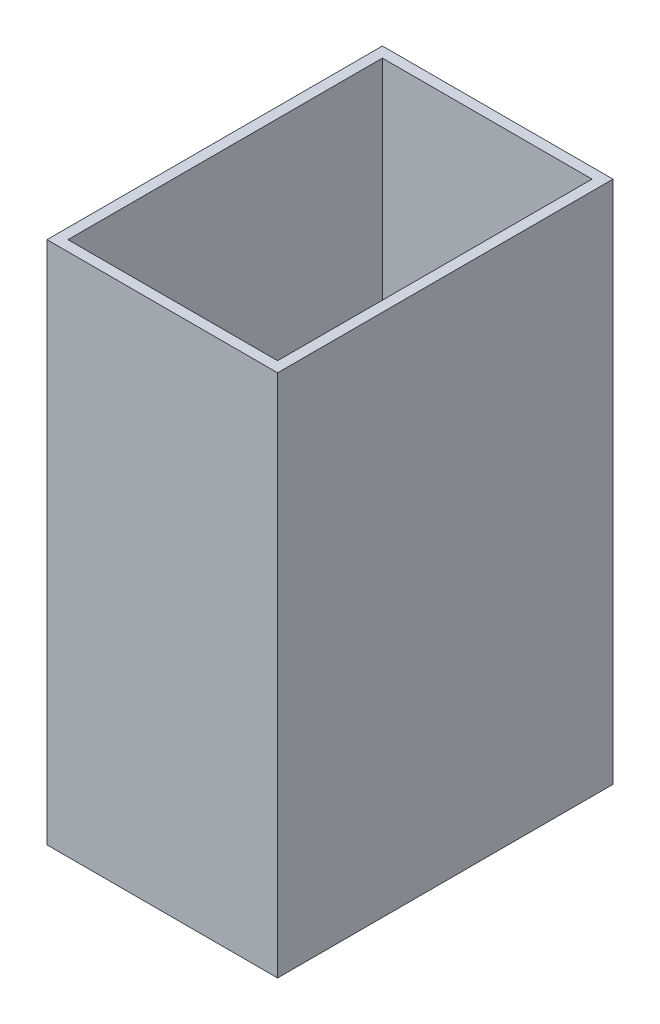
ISO-10303-21;
HEADER;
FILE_DESCRIPTION(('STEP AP214'),'2;1');
FILE_NAME('part.step','',(''),(''),'','','');
FILE_SCHEMA(('AUTOMOTIVE_DESIGN { 1 0 10303 214 1 1 1 1 }'));
ENDSEC;
DATA;
#1=APPLICATION_CONTEXT('core data for automotive mechanical design processes');
#2=APPLICATION_PROTOCOL_DEFINITION('international standard','automotive_design',2000,#1);
#3=PRODUCT_CONTEXT('',#1,'mechanical');
#4=PRODUCT('Part','Part','',(#3));
#5=PRODUCT_RELATED_PRODUCT_CATEGORY('part','',(#4));
#6=PRODUCT_DEFINITION_FORMATION('','',#4);
#7=PRODUCT_DEFINITION_CONTEXT('part definition',#1,'design');
#8=PRODUCT_DEFINITION('design','',#6,#7);
#9=PRODUCT_DEFINITION_SHAPE('','',#8);
#10=(LENGTH_UNIT() NAMED_UNIT(*) SI_UNIT(.MILLI.,.METRE.));
#11=(NAMED_UNIT(*) PLANE_ANGLE_UNIT() SI_UNIT($,.RADIAN.));
#12=(NAMED_UNIT(*) SI_UNIT($,.STERADIAN.) SOLID_ANGLE_UNIT());
#13=UNCERTAINTY_MEASURE_WITH_UNIT(LENGTH_MEASURE(1.E-05),#10,'distance_accuracy_value','');
#14=(GEOMETRIC_REPRESENTATION_CONTEXT(3) GLOBAL_UNCERTAINTY_ASSIGNED_CONTEXT((#13)) GLOBAL_UNIT_ASSIGNED_CONTEXT((#10,
#11,#12)) REPRESENTATION_CONTEXT('',''));
#15=CARTESIAN_POINT('',(0.,0.,0.));
#16=DIRECTION('',(0.,0.,1.));
#17=DIRECTION('',(1.,0.,0.));
#18=AXIS2_PLACEMENT_3D('',#15,#16,#17);
#19=CARTESIAN_POINT('',(0.,500.,0.));
#20=DIRECTION('',(0.,1.,0.));
#21=DIRECTION('',(0.,0.,1.));
#22=AXIS2_PLACEMENT_3D('',#19,#20,#21);
#23=PLANE('',#22);
#24=DIRECTION('',(0.,0.,-1.));
#25=VECTOR('',#24,1.);
#26=CARTESIAN_POINT('',(110.,500.,-160.));
#27=LINE('',#26,#25);
#28=CARTESIAN_POINT('',(110.,500.,160.));
#29=VERTEX_POINT('',#28);
#30=CARTESIAN_POINT('',(110.,500.,-160.));
#31=VERTEX_POINT('',#30);
#32=EDGE_CURVE('E136',#29,#31,#27,.T.);
#33=ORIENTED_EDGE('',*,*,#32,.T.);
#34=DIRECTION('',(-1.,0.,0.));
#35=VECTOR('',#34,1.);
#36=CARTESIAN_POINT('',(-110.,500.,-160.));
#37=LINE('',#36,#35);
#38=CARTESIAN_POINT('',(-110.,500.,-160.));
#39=VERTEX_POINT('',#38);
#40=EDGE_CURVE('E139',#31,#39,#37,.T.);
#41=ORIENTED_EDGE('',*,*,#40,.T.);
#42=DIRECTION('',(0.,0.,1.));
#43=VECTOR('',#42,1.);
#44=CARTESIAN_POINT('',(-110.,500.,-160.));
#45=LINE('',#44,#43);
#46=CARTESIAN_POINT('',(-110.,500.,160.));
#47=VERTEX_POINT('',#46);
#48=EDGE_CURVE('E142',#39,#47,#45,.T.);
#49=ORIENTED_EDGE('',*,*,#48,.T.);
#50=DIRECTION('',(1.,0.,0.));
#51=VECTOR('',#50,1.);
#52=CARTESIAN_POINT('',(-110.,500.,160.));
#53=LINE('',#52,#51);
#54=EDGE_CURVE('E144',#47,#29,#53,.T.);
#55=ORIENTED_EDGE('',*,*,#54,.T.);
#56=EDGE_LOOP('',(#33,#41,#49,#55));
#57=FACE_BOUND('',#56,.T.);
#58=DIRECTION('',(-1.,0.,0.));
#59=VECTOR('',#58,1.);
#60=CARTESIAN_POINT('',(-100.,500.,-150.));
#61=LINE('',#60,#59);
#62=CARTESIAN_POINT('',(100.,500.,-150.));
#63=VERTEX_POINT('',#62);
#64=CARTESIAN_POINT('',(-100.,500.,-150.));
#65=VERTEX_POINT('',#64);
#66=EDGE_CURVE('E108',#63,#65,#61,.T.);
#67=ORIENTED_EDGE('',*,*,#66,.F.);
#68=DIRECTION('',(0.,0.,-1.));
#69=VECTOR('',#68,1.);
#70=CARTESIAN_POINT('',(100.,500.,-150.));
#71=LINE('',#70,#69);
#72=CARTESIAN_POINT('',(100.,500.,150.));
#73=VERTEX_POINT('',#72);
#74=EDGE_CURVE('E100',#73,#63,#71,.T.);
#75=ORIENTED_EDGE('',*,*,#74,.F.);
#76=DIRECTION('',(1.,0.,0.));
#77=VECTOR('',#76,1.);
#78=CARTESIAN_POINT('',(-99.9999999999999,500.,150.));
#79=LINE('',#78,#77);
#80=CARTESIAN_POINT('',(-99.9999999999999,500.,150.));
#81=VERTEX_POINT('',#80);
#82=EDGE_CURVE('E122',#81,#73,#79,.T.);
#83=ORIENTED_EDGE('',*,*,#82,.F.);
#84=DIRECTION('',(0.,0.,1.));
#85=VECTOR('',#84,1.);
#86=CARTESIAN_POINT('',(-100.,500.,-150.));
#87=LINE('',#86,#85);
#88=EDGE_CURVE('E120',#65,#81,#87,.T.);
#89=ORIENTED_EDGE('',*,*,#88,.F.);
#90=EDGE_LOOP('',(#67,#75,#83,#89));
#91=FACE_BOUND('',#90,.T.);
#92=ADVANCED_FACE('F35',(#57,#91),#23,.T.);
#93=CARTESIAN_POINT('',(0.,0.,0.));
#94=DIRECTION('',(0.,1.,0.));
#95=DIRECTION('',(0.,0.,1.));
#96=AXIS2_PLACEMENT_3D('',#93,#94,#95);
#97=PLANE('',#96);
#98=DIRECTION('',(0.,0.,-1.));
#99=VECTOR('',#98,1.);
#100=CARTESIAN_POINT('',(110.,0.,-160.));
#101=LINE('',#100,#99);
#102=CARTESIAN_POINT('',(110.,0.,160.));
#103=VERTEX_POINT('',#102);
#104=CARTESIAN_POINT('',(110.,0.,-160.));
#105=VERTEX_POINT('',#104);
#106=EDGE_CURVE('E116',#103,#105,#101,.T.);
#107=ORIENTED_EDGE('',*,*,#106,.F.);
#108=DIRECTION('',(1.,0.,0.));
#109=VECTOR('',#108,1.);
#110=CARTESIAN_POINT('',(-110.,0.,160.));
#111=LINE('',#110,#109);
#112=CARTESIAN_POINT('',(-110.,0.,160.));
#113=VERTEX_POINT('',#112);
#114=EDGE_CURVE('E140',#113,#103,#111,.T.);
#115=ORIENTED_EDGE('',*,*,#114,.F.);
#116=DIRECTION('',(0.,0.,1.));
#117=VECTOR('',#116,1.);
#118=CARTESIAN_POINT('',(-110.,0.,-160.));
#119=LINE('',#118,#117);
#120=CARTESIAN_POINT('',(-110.,0.,-160.));
#121=VERTEX_POINT('',#120);
#122=EDGE_CURVE('E151',#121,#113,#119,.T.);
#123=ORIENTED_EDGE('',*,*,#122,.F.);
#124=DIRECTION('',(-1.,0.,0.));
#125=VECTOR('',#124,1.);
#126=CARTESIAN_POINT('',(-110.,0.,-160.));
#127=LINE('',#126,#125);
#128=EDGE_CURVE('E149',#105,#121,#127,.T.);
#129=ORIENTED_EDGE('',*,*,#128,.F.);
#130=EDGE_LOOP('',(#107,#115,#123,#129));
#131=FACE_BOUND('',#130,.T.);
#132=DIRECTION('',(0.,0.,-1.));
#133=VECTOR('',#132,1.);
#134=CARTESIAN_POINT('',(100.,0.,-150.));
#135=LINE('',#134,#133);
#136=CARTESIAN_POINT('',(100.,0.,150.));
#137=VERTEX_POINT('',#136);
#138=CARTESIAN_POINT('',(100.,0.,-150.));
#139=VERTEX_POINT('',#138);
#140=EDGE_CURVE('E58',#137,#139,#135,.T.);
#141=ORIENTED_EDGE('',*,*,#140,.T.);
#142=DIRECTION('',(-1.,0.,0.));
#143=VECTOR('',#142,1.);
#144=CARTESIAN_POINT('',(-100.,0.,-150.));
#145=LINE('',#144,#143);
#146=CARTESIAN_POINT('',(-100.,0.,-150.));
#147=VERTEX_POINT('',#146);
#148=EDGE_CURVE('E115',#139,#147,#145,.T.);
#149=ORIENTED_EDGE('',*,*,#148,.T.);
#150=DIRECTION('',(0.,0.,1.));
#151=VECTOR('',#150,1.);
#152=CARTESIAN_POINT('',(-100.,0.,-150.));
#153=LINE('',#152,#151);
#154=CARTESIAN_POINT('',(-99.9999999999999,0.,150.));
#155=VERTEX_POINT('',#154);
#156=EDGE_CURVE('E128',#147,#155,#153,.T.);
#157=ORIENTED_EDGE('',*,*,#156,.T.);
#158=DIRECTION('',(1.,0.,0.));
#159=VECTOR('',#158,1.);
#160=CARTESIAN_POINT('',(-99.9999999999999,0.,150.));
#161=LINE('',#160,#159);
#162=EDGE_CURVE('E109',#155,#137,#161,.T.);
#163=ORIENTED_EDGE('',*,*,#162,.T.);
#164=EDGE_LOOP('',(#141,#149,#157,#163));
#165=FACE_BOUND('',#164,.T.);
#166=ADVANCED_FACE('F169',(#131,#165),#97,.F.);
#167=CARTESIAN_POINT('',(110.,500.,-160.));
#168=DIRECTION('',(-1.,0.,0.));
#169=DIRECTION('',(0.,0.,1.));
#170=AXIS2_PLACEMENT_3D('',#167,#168,#169);
#171=PLANE('',#170);
#172=ORIENTED_EDGE('',*,*,#106,.T.);
#173=DIRECTION('',(0.,-1.,0.));
#174=VECTOR('',#173,1.);
#175=CARTESIAN_POINT('',(110.,500.,-160.));
#176=LINE('',#175,#174);
#177=EDGE_CURVE('E11',#31,#105,#176,.T.);
#178=ORIENTED_EDGE('',*,*,#177,.F.);
#179=ORIENTED_EDGE('',*,*,#32,.F.);
#180=DIRECTION('',(0.,-1.,0.));
#181=VECTOR('',#180,1.);
#182=CARTESIAN_POINT('',(110.,500.,160.));
#183=LINE('',#182,#181);
#184=EDGE_CURVE('E146',#29,#103,#183,.T.);
#185=ORIENTED_EDGE('',*,*,#184,.T.);
#186=EDGE_LOOP('',(#172,#178,#179,#185));
#187=FACE_BOUND('',#186,.T.);
#188=ADVANCED_FACE('F37',(#187),#171,.F.);
#189=CARTESIAN_POINT('',(-110.,500.,-160.));
#190=DIRECTION('',(0.,0.,1.));
#191=DIRECTION('',(1.,0.,0.));
#192=AXIS2_PLACEMENT_3D('',#189,#190,#191);
#193=PLANE('',#192);
#194=ORIENTED_EDGE('',*,*,#128,.T.);
#195=DIRECTION('',(0.,-1.,0.));
#196=VECTOR('',#195,1.);
#197=CARTESIAN_POINT('',(-110.,500.,-160.));
#198=LINE('',#197,#196);
#199=EDGE_CURVE('E43',#39,#121,#198,.T.);
#200=ORIENTED_EDGE('',*,*,#199,.F.);
#201=ORIENTED_EDGE('',*,*,#40,.F.);
#202=ORIENTED_EDGE('',*,*,#177,.T.);
#203=EDGE_LOOP('',(#194,#200,#201,#202));
#204=FACE_BOUND('',#203,.T.);
#205=ADVANCED_FACE('F179',(#204),#193,.F.);
#206=CARTESIAN_POINT('',(-110.,500.,-160.));
#207=DIRECTION('',(1.,0.,0.));
#208=DIRECTION('',(0.,0.,-1.));
#209=AXIS2_PLACEMENT_3D('',#206,#207,#208);
#210=PLANE('',#209);
#211=ORIENTED_EDGE('',*,*,#122,.T.);
#212=DIRECTION('',(0.,-1.,0.));
#213=VECTOR('',#212,1.);
#214=CARTESIAN_POINT('',(-110.,500.,160.));
#215=LINE('',#214,#213);
#216=EDGE_CURVE('E156',#47,#113,#215,.T.);
#217=ORIENTED_EDGE('',*,*,#216,.F.);
#218=ORIENTED_EDGE('',*,*,#48,.F.);
#219=ORIENTED_EDGE('',*,*,#199,.T.);
#220=EDGE_LOOP('',(#211,#217,#218,#219));
#221=FACE_BOUND('',#220,.T.);
#222=ADVANCED_FACE('F163',(#221),#210,.F.);
#223=CARTESIAN_POINT('',(-110.,500.,160.));
#224=DIRECTION('',(0.,0.,-1.));
#225=DIRECTION('',(-1.,0.,0.));
#226=AXIS2_PLACEMENT_3D('',#223,#224,#225);
#227=PLANE('',#226);
#228=ORIENTED_EDGE('',*,*,#114,.T.);
#229=ORIENTED_EDGE('',*,*,#184,.F.);
#230=ORIENTED_EDGE('',*,*,#54,.F.);
#231=ORIENTED_EDGE('',*,*,#216,.T.);
#232=EDGE_LOOP('',(#228,#229,#230,#231));
#233=FACE_BOUND('',#232,.T.);
#234=ADVANCED_FACE('F173',(#233),#227,.F.);
#235=CARTESIAN_POINT('',(100.,500.,-150.));
#236=DIRECTION('',(-1.,0.,0.));
#237=DIRECTION('',(0.,0.,1.));
#238=AXIS2_PLACEMENT_3D('',#235,#236,#237);
#239=PLANE('',#238);
#240=ORIENTED_EDGE('',*,*,#140,.F.);
#241=DIRECTION('',(0.,-1.,0.));
#242=VECTOR('',#241,1.);
#243=CARTESIAN_POINT('',(100.,500.,150.));
#244=LINE('',#243,#242);
#245=EDGE_CURVE('E104',#73,#137,#244,.T.);
#246=ORIENTED_EDGE('',*,*,#245,.F.);
#247=ORIENTED_EDGE('',*,*,#74,.T.);
#248=DIRECTION('',(0.,-1.,0.));
#249=VECTOR('',#248,1.);
#250=CARTESIAN_POINT('',(100.,500.,-150.));
#251=LINE('',#250,#249);
#252=EDGE_CURVE('E103',#63,#139,#251,.T.);
#253=ORIENTED_EDGE('',*,*,#252,.T.);
#254=EDGE_LOOP('',(#240,#246,#247,#253));
#255=FACE_BOUND('',#254,.T.);
#256=ADVANCED_FACE('F102',(#255),#239,.T.);
#257=CARTESIAN_POINT('',(-100.,500.,-150.));
#258=DIRECTION('',(0.,0.,1.));
#259=DIRECTION('',(1.,0.,0.));
#260=AXIS2_PLACEMENT_3D('',#257,#258,#259);
#261=PLANE('',#260);
#262=ORIENTED_EDGE('',*,*,#148,.F.);
#263=ORIENTED_EDGE('',*,*,#252,.F.);
#264=ORIENTED_EDGE('',*,*,#66,.T.);
#265=DIRECTION('',(0.,-1.,0.));
#266=VECTOR('',#265,1.);
#267=CARTESIAN_POINT('',(-100.,500.,-150.));
#268=LINE('',#267,#266);
#269=EDGE_CURVE('E117',#65,#147,#268,.T.);
#270=ORIENTED_EDGE('',*,*,#269,.T.);
#271=EDGE_LOOP('',(#262,#263,#264,#270));
#272=FACE_BOUND('',#271,.T.);
#273=ADVANCED_FACE('F112',(#272),#261,.T.);
#274=CARTESIAN_POINT('',(-100.,500.,-150.));
#275=DIRECTION('',(1.,0.,0.));
#276=DIRECTION('',(0.,0.,-1.));
#277=AXIS2_PLACEMENT_3D('',#274,#275,#276);
#278=PLANE('',#277);
#279=ORIENTED_EDGE('',*,*,#156,.F.);
#280=ORIENTED_EDGE('',*,*,#269,.F.);
#281=ORIENTED_EDGE('',*,*,#88,.T.);
#282=DIRECTION('',(0.,-1.,0.));
#283=VECTOR('',#282,1.);
#284=CARTESIAN_POINT('',(-99.9999999999999,500.,150.));
#285=LINE('',#284,#283);
#286=EDGE_CURVE('E50',#81,#155,#285,.T.);
#287=ORIENTED_EDGE('',*,*,#286,.T.);
#288=EDGE_LOOP('',(#279,#280,#281,#287));
#289=FACE_BOUND('',#288,.T.);
#290=ADVANCED_FACE('F202',(#289),#278,.T.);
#291=CARTESIAN_POINT('',(-99.9999999999999,500.,150.));
#292=DIRECTION('',(0.,0.,-1.));
#293=DIRECTION('',(-1.,0.,0.));
#294=AXIS2_PLACEMENT_3D('',#291,#292,#293);
#295=PLANE('',#294);
#296=ORIENTED_EDGE('',*,*,#162,.F.);
#297=ORIENTED_EDGE('',*,*,#286,.F.);
#298=ORIENTED_EDGE('',*,*,#82,.T.);
#299=ORIENTED_EDGE('',*,*,#245,.T.);
#300=EDGE_LOOP('',(#296,#297,#298,#299));
#301=FACE_BOUND('',#300,.T.);
#302=ADVANCED_FACE('F206',(#301),#295,.T.);
#303=CLOSED_SHELL('',(#92,#166,#188,#205,#222,#234,#256,#273,#290,#302));
#304=MANIFOLD_SOLID_BREP('B2',#303);
#305=ADVANCED_BREP_SHAPE_REPRESENTATION('',(#18,#304),#14);
#306=SHAPE_DEFINITION_REPRESENTATION(#9,#305);
ENDSEC;
END-ISO-10303-21;
